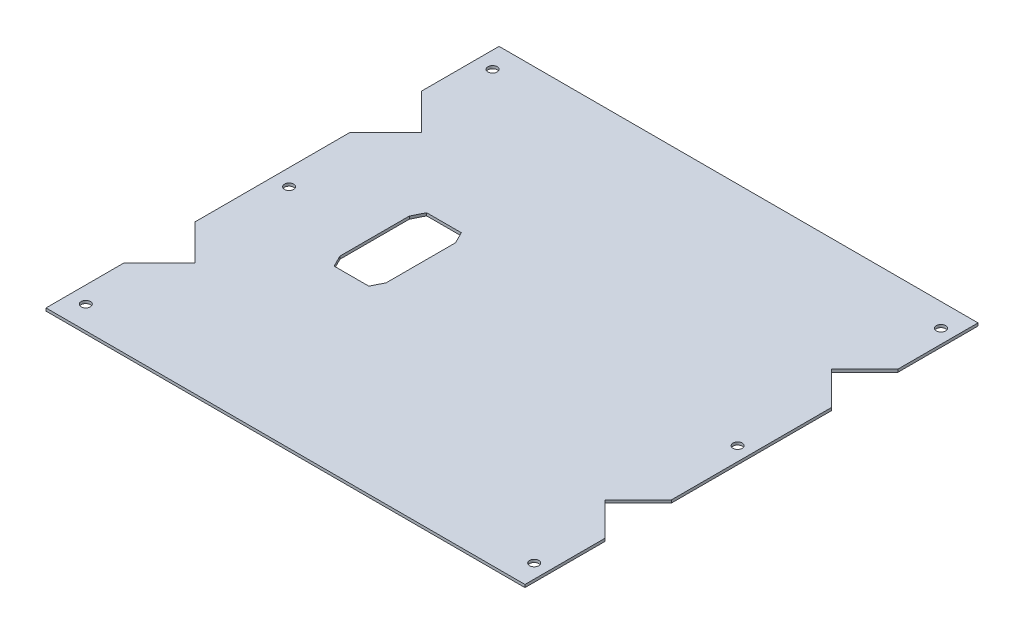
ISO-10303-21;
HEADER;
FILE_DESCRIPTION(('STEP AP214'),'2;1');
FILE_NAME('part.step','',(''),(''),'','','');
FILE_SCHEMA(('AUTOMOTIVE_DESIGN { 1 0 10303 214 1 1 1 1 }'));
ENDSEC;
DATA;
#1=APPLICATION_CONTEXT('core data for automotive mechanical design processes');
#2=APPLICATION_PROTOCOL_DEFINITION('international standard','automotive_design',2000,#1);
#3=PRODUCT_CONTEXT('',#1,'mechanical');
#4=PRODUCT('Part','Part','',(#3));
#5=PRODUCT_RELATED_PRODUCT_CATEGORY('part','',(#4));
#6=PRODUCT_DEFINITION_FORMATION('','',#4);
#7=PRODUCT_DEFINITION_CONTEXT('part definition',#1,'design');
#8=PRODUCT_DEFINITION('design','',#6,#7);
#9=PRODUCT_DEFINITION_SHAPE('','',#8);
#10=(LENGTH_UNIT() NAMED_UNIT(*) SI_UNIT(.MILLI.,.METRE.));
#11=(NAMED_UNIT(*) PLANE_ANGLE_UNIT() SI_UNIT($,.RADIAN.));
#12=(NAMED_UNIT(*) SI_UNIT($,.STERADIAN.) SOLID_ANGLE_UNIT());
#13=UNCERTAINTY_MEASURE_WITH_UNIT(LENGTH_MEASURE(1.E-05),#10,'distance_accuracy_value','');
#14=(GEOMETRIC_REPRESENTATION_CONTEXT(3) GLOBAL_UNCERTAINTY_ASSIGNED_CONTEXT((#13)) GLOBAL_UNIT_ASSIGNED_CONTEXT((#10,
#11,#12)) REPRESENTATION_CONTEXT('',''));
#15=CARTESIAN_POINT('',(0.,0.,0.));
#16=DIRECTION('',(0.,0.,1.));
#17=DIRECTION('',(1.,0.,0.));
#18=AXIS2_PLACEMENT_3D('',#15,#16,#17);
#19=CARTESIAN_POINT('',(0.,1.2,0.));
#20=DIRECTION('',(0.,-1.,0.));
#21=DIRECTION('',(0.,0.,-1.));
#22=AXIS2_PLACEMENT_3D('',#19,#20,#21);
#23=PLANE('',#22);
#24=DIRECTION('',(0.707106781186555,0.,0.70710678118654));
#25=VECTOR('',#24,1.);
#26=CARTESIAN_POINT('',(-6.94800186834975,1.19999999999923,-9.37677669530754));
#27=LINE('',#26,#25);
#28=CARTESIAN_POINT('',(-14.1247785636571,1.19999999999916,-16.5535533906148));
#29=VERTEX_POINT('',#28);
#30=CARTESIAN_POINT('',(1.39116410875926,1.19999999999932,-1.0376107181987));
#31=VERTEX_POINT('',#30);
#32=EDGE_CURVE('E728',#29,#31,#27,.T.);
#33=ORIENTED_EDGE('',*,*,#32,.T.);
#34=DIRECTION('',(-0.707106781186548,0.,0.707106781186547));
#35=VECTOR('',#34,1.);
#36=CARTESIAN_POINT('',(-30.8480018683815,1.1999999999987,31.201555258942));
#37=LINE('',#36,#35);
#38=CARTESIAN_POINT('',(-14.1247785636572,1.19999999999876,14.4783319542178));
#39=VERTEX_POINT('',#38);
#40=EDGE_CURVE('E616',#31,#39,#37,.T.);
#41=ORIENTED_EDGE('',*,*,#40,.T.);
#42=DIRECTION('',(0.,0.,1.));
#43=VECTOR('',#42,1.);
#44=CARTESIAN_POINT('',(-14.1247785636572,1.19999999999864,47.9247785636663));
#45=LINE('',#44,#43);
#46=CARTESIAN_POINT('',(-14.1247785636572,1.19999999999864,47.9247785636663));
#47=VERTEX_POINT('',#46);
#48=EDGE_CURVE('E630',#47,#39,#45,.F.);
#49=ORIENTED_EDGE('',*,*,#48,.F.);
#50=DIRECTION('',(1.,0.,0.));
#51=VECTOR('',#50,1.);
#52=CARTESIAN_POINT('',(192.924778563662,1.19999999999861,47.9247785636663));
#53=LINE('',#52,#51);
#54=CARTESIAN_POINT('',(192.924778563662,1.19999999999861,47.924778563666));
#55=VERTEX_POINT('',#54);
#56=EDGE_CURVE('E619',#47,#55,#53,.T.);
#57=ORIENTED_EDGE('',*,*,#56,.T.);
#58=DIRECTION('',(0.,0.,-1.));
#59=VECTOR('',#58,1.);
#60=CARTESIAN_POINT('',(192.924778563662,1.19999999999961,0.124778563666265));
#61=LINE('',#60,#59);
#62=CARTESIAN_POINT('',(192.924778563662,1.19999999999932,13.2783319542393));
#63=VERTEX_POINT('',#62);
#64=EDGE_CURVE('E639',#63,#55,#61,.F.);
#65=ORIENTED_EDGE('',*,*,#64,.F.);
#66=DIRECTION('',(-0.70710678118656,0.,-0.707106781186535));
#67=VECTOR('',#66,1.);
#68=CARTESIAN_POINT('',(186.348001868375,1.19999999999945,6.70155525895304));
#69=LINE('',#68,#67);
#70=CARTESIAN_POINT('',(178.608835891259,1.19999999999966,-1.03761071816298));
#71=VERTEX_POINT('',#70);
#72=EDGE_CURVE('E622',#63,#71,#69,.T.);
#73=ORIENTED_EDGE('',*,*,#72,.T.);
#74=DIRECTION('',(0.707106781186542,0.,-0.707106781186553));
#75=VECTOR('',#74,1.);
#76=CARTESIAN_POINT('',(234.148001868379,1.19999999999978,-56.5767766952838));
#77=LINE('',#76,#75);
#78=CARTESIAN_POINT('',(192.924778563662,1.19999999999956,-15.3535533905662));
#79=VERTEX_POINT('',#78);
#80=EDGE_CURVE('E702',#71,#79,#77,.T.);
#81=ORIENTED_EDGE('',*,*,#80,.T.);
#82=DIRECTION('',(0.,0.,-1.));
#83=VECTOR('',#82,1.);
#84=CARTESIAN_POINT('',(192.924778563662,1.20000000000015,-97.8));
#85=LINE('',#84,#83);
#86=CARTESIAN_POINT('',(192.924778563662,1.20000000000003,-84.6464466093866));
#87=VERTEX_POINT('',#86);
#88=EDGE_CURVE('E711',#87,#79,#85,.F.);
#89=ORIENTED_EDGE('',*,*,#88,.F.);
#90=DIRECTION('',(-0.707106781186554,0.,-0.707106781186541));
#91=VECTOR('',#90,1.);
#92=CARTESIAN_POINT('',(186.348001868355,1.20000000000009,-91.2232233046932));
#93=LINE('',#92,#91);
#94=CARTESIAN_POINT('',(178.608835891231,1.20000000000018,-98.9623892818179));
#95=VERTEX_POINT('',#94);
#96=EDGE_CURVE('E700',#87,#95,#93,.T.);
#97=ORIENTED_EDGE('',*,*,#96,.T.);
#98=DIRECTION('',(0.707106781186549,0.,-0.707106781186546));
#99=VECTOR('',#98,1.);
#100=CARTESIAN_POINT('',(210.248001868367,1.19999999999959,-130.601555258954));
#101=LINE('',#100,#99);
#102=CARTESIAN_POINT('',(192.924778563662,1.19999999999973,-113.278331954249));
#103=VERTEX_POINT('',#102);
#104=EDGE_CURVE('E595',#95,#103,#101,.T.);
#105=ORIENTED_EDGE('',*,*,#104,.T.);
#106=DIRECTION('',(0.,0.,-1.));
#107=VECTOR('',#106,1.);
#108=CARTESIAN_POINT('',(192.924778563662,1.19999999999949,-147.924778563659));
#109=LINE('',#108,#107);
#110=CARTESIAN_POINT('',(192.924778563662,1.19999999999949,-147.924778563659));
#111=VERTEX_POINT('',#110);
#112=EDGE_CURVE('E665',#111,#103,#109,.F.);
#113=ORIENTED_EDGE('',*,*,#112,.F.);
#114=DIRECTION('',(1.,0.,0.));
#115=VECTOR('',#114,1.);
#116=CARTESIAN_POINT('',(192.924778563662,1.19999999999949,-147.924778563659));
#117=LINE('',#116,#115);
#118=CARTESIAN_POINT('',(-14.1247785636571,1.19999999999783,-147.924778563659));
#119=VERTEX_POINT('',#118);
#120=EDGE_CURVE('E661',#111,#119,#117,.F.);
#121=ORIENTED_EDGE('',*,*,#120,.T.);
#122=DIRECTION('',(0.,0.,1.));
#123=VECTOR('',#122,1.);
#124=CARTESIAN_POINT('',(-14.1247785636571,1.19999999999899,-100.124778563659));
#125=LINE('',#124,#123);
#126=CARTESIAN_POINT('',(-14.1247785636571,1.19999999999865,-114.478331954274));
#127=VERTEX_POINT('',#126);
#128=EDGE_CURVE('E676',#127,#119,#125,.F.);
#129=ORIENTED_EDGE('',*,*,#128,.F.);
#130=DIRECTION('',(0.707106781186561,0.,0.707106781186534));
#131=VECTOR('',#130,1.);
#132=CARTESIAN_POINT('',(-6.94800186834975,1.19999999999883,-107.301555258966));
#133=LINE('',#132,#131);
#134=CARTESIAN_POINT('',(1.39116410876367,1.19999999999902,-98.9623892818534));
#135=VERTEX_POINT('',#134);
#136=EDGE_CURVE('E659',#127,#135,#133,.T.);
#137=ORIENTED_EDGE('',*,*,#136,.T.);
#138=DIRECTION('',(-0.707106781186541,0.,0.707106781186554));
#139=VECTOR('',#138,1.);
#140=CARTESIAN_POINT('',(-54.7480018683733,1.19999999999889,-42.8232233047154));
#141=LINE('',#140,#139);
#142=CARTESIAN_POINT('',(-14.1247785636571,1.19999999999846,-83.4464466094323));
#143=VERTEX_POINT('',#142);
#144=EDGE_CURVE('E730',#135,#143,#141,.T.);
#145=ORIENTED_EDGE('',*,*,#144,.T.);
#146=DIRECTION('',(0.,0.,1.));
#147=VECTOR('',#146,1.);
#148=CARTESIAN_POINT('',(-14.1247785636571,1.19999999999931,-2.2));
#149=LINE('',#148,#147);
#150=EDGE_CURVE('E736',#29,#143,#149,.F.);
#151=ORIENTED_EDGE('',*,*,#150,.F.);
#152=EDGE_LOOP('',(#33,#41,#49,#57,#65,#73,#81,#89,#97,#105,#113,#121,#129,#137,#145,#151));
#153=FACE_BOUND('',#152,.T.);
#154=DIRECTION('',(-0.447213595499958,0.,0.894427190999916));
#155=VECTOR('',#154,1.);
#156=CARTESIAN_POINT('',(30.,1.2,-65.));
#157=LINE('',#156,#155);
#158=CARTESIAN_POINT('',(32.5,1.2,-70.));
#159=VERTEX_POINT('',#158);
#160=CARTESIAN_POINT('',(30.,1.2,-65.));
#161=VERTEX_POINT('',#160);
#162=EDGE_CURVE('E740',#159,#161,#157,.T.);
#163=ORIENTED_EDGE('',*,*,#162,.F.);
#164=DIRECTION('',(-1.,0.,0.));
#165=VECTOR('',#164,1.);
#166=CARTESIAN_POINT('',(32.5,1.2,-70.));
#167=LINE('',#166,#165);
#168=CARTESIAN_POINT('',(47.5,1.2,-70.));
#169=VERTEX_POINT('',#168);
#170=EDGE_CURVE('E755',#169,#159,#167,.T.);
#171=ORIENTED_EDGE('',*,*,#170,.F.);
#172=DIRECTION('',(-0.447213595499958,0.,-0.894427190999916));
#173=VECTOR('',#172,1.);
#174=CARTESIAN_POINT('',(47.5,1.2,-70.));
#175=LINE('',#174,#173);
#176=CARTESIAN_POINT('',(50.,1.2,-65.));
#177=VERTEX_POINT('',#176);
#178=EDGE_CURVE('E753',#177,#169,#175,.T.);
#179=ORIENTED_EDGE('',*,*,#178,.F.);
#180=DIRECTION('',(0.,0.,-1.));
#181=VECTOR('',#180,1.);
#182=CARTESIAN_POINT('',(50.,1.2,-65.));
#183=LINE('',#182,#181);
#184=CARTESIAN_POINT('',(50.,1.2,-35.));
#185=VERTEX_POINT('',#184);
#186=EDGE_CURVE('E751',#185,#177,#183,.T.);
#187=ORIENTED_EDGE('',*,*,#186,.F.);
#188=DIRECTION('',(0.447213595499959,0.,-0.894427190999915));
#189=VECTOR('',#188,1.);
#190=CARTESIAN_POINT('',(50.,1.2,-35.));
#191=LINE('',#190,#189);
#192=CARTESIAN_POINT('',(47.5,1.2,-30.));
#193=VERTEX_POINT('',#192);
#194=EDGE_CURVE('E749',#193,#185,#191,.T.);
#195=ORIENTED_EDGE('',*,*,#194,.F.);
#196=DIRECTION('',(1.,0.,0.));
#197=VECTOR('',#196,1.);
#198=CARTESIAN_POINT('',(47.5,1.2,-30.));
#199=LINE('',#198,#197);
#200=CARTESIAN_POINT('',(32.5,1.2,-30.));
#201=VERTEX_POINT('',#200);
#202=EDGE_CURVE('E747',#201,#193,#199,.T.);
#203=ORIENTED_EDGE('',*,*,#202,.F.);
#204=DIRECTION('',(0.447213595499958,0.,0.894427190999916));
#205=VECTOR('',#204,1.);
#206=CARTESIAN_POINT('',(32.5,1.2,-30.));
#207=LINE('',#206,#205);
#208=CARTESIAN_POINT('',(30.,1.2,-35.));
#209=VERTEX_POINT('',#208);
#210=EDGE_CURVE('E745',#209,#201,#207,.T.);
#211=ORIENTED_EDGE('',*,*,#210,.F.);
#212=DIRECTION('',(0.,0.,1.));
#213=VECTOR('',#212,1.);
#214=CARTESIAN_POINT('',(30.,1.2,-65.));
#215=LINE('',#214,#213);
#216=EDGE_CURVE('E742',#161,#209,#215,.T.);
#217=ORIENTED_EDGE('',*,*,#216,.F.);
#218=EDGE_LOOP('',(#163,#171,#179,#187,#195,#203,#211,#217));
#219=FACE_BOUND('',#218,.T.);
#220=CARTESIAN_POINT('',(-6.9247785635766,1.19999999999881,-49.9999999999999));
#221=DIRECTION('',(0.,1.,0.));
#222=DIRECTION('',(-1.,0.,0.));
#223=AXIS2_PLACEMENT_3D('',#220,#221,#222);
#224=CIRCLE('',#223,2.);
#225=CARTESIAN_POINT('',(-8.92477856357661,1.19999999999881,-49.9999999999999));
#226=VERTEX_POINT('',#225);
#227=EDGE_CURVE('E733',#226,#226,#224,.T.);
#228=ORIENTED_EDGE('',*,*,#227,.F.);
#229=EDGE_LOOP('',(#228));
#230=FACE_BOUND('',#229,.T.);
#231=CARTESIAN_POINT('',(186.924778563663,1.19999999999984,-50.0000000000001));
#232=DIRECTION('',(0.,1.,0.));
#233=DIRECTION('',(-1.,0.,0.));
#234=AXIS2_PLACEMENT_3D('',#231,#232,#233);
#235=CIRCLE('',#234,2.);
#236=CARTESIAN_POINT('',(184.924778563663,1.19999999999984,-50.));
#237=VERTEX_POINT('',#236);
#238=EDGE_CURVE('E708',#237,#237,#235,.T.);
#239=ORIENTED_EDGE('',*,*,#238,.F.);
#240=EDGE_LOOP('',(#239));
#241=FACE_BOUND('',#240,.T.);
#242=CARTESIAN_POINT('',(-6.92477856365785,1.19999999999808,-137.924778563577));
#243=DIRECTION('',(0.,1.,0.));
#244=DIRECTION('',(1.,0.,0.));
#245=AXIS2_PLACEMENT_3D('',#242,#243,#244);
#246=CIRCLE('',#245,2.);
#247=CARTESIAN_POINT('',(-4.92477856365785,1.19999999999808,-137.924778563577));
#248=VERTEX_POINT('',#247);
#249=EDGE_CURVE('E686',#248,#248,#246,.T.);
#250=ORIENTED_EDGE('',*,*,#249,.F.);
#251=EDGE_LOOP('',(#250));
#252=FACE_BOUND('',#251,.T.);
#253=CARTESIAN_POINT('',(186.924778563663,1.19999999999959,-137.924778563658));
#254=DIRECTION('',(0.,1.,0.));
#255=DIRECTION('',(1.,0.,0.));
#256=AXIS2_PLACEMENT_3D('',#253,#254,#255);
#257=CIRCLE('',#256,2.);
#258=CARTESIAN_POINT('',(188.924778563663,1.19999999999959,-137.924778563658));
#259=VERTEX_POINT('',#258);
#260=EDGE_CURVE('E610',#259,#259,#257,.T.);
#261=ORIENTED_EDGE('',*,*,#260,.F.);
#262=EDGE_LOOP('',(#261));
#263=FACE_BOUND('',#262,.T.);
#264=CARTESIAN_POINT('',(-6.92477856365739,1.19999999999868,37.9247785636069));
#265=DIRECTION('',(0.,1.,0.));
#266=DIRECTION('',(-1.,0.,0.));
#267=AXIS2_PLACEMENT_3D('',#264,#265,#266);
#268=CIRCLE('',#267,2.);
#269=CARTESIAN_POINT('',(-8.92477856365739,1.19999999999868,37.9247785636069));
#270=VERTEX_POINT('',#269);
#271=EDGE_CURVE('E644',#270,#270,#268,.T.);
#272=ORIENTED_EDGE('',*,*,#271,.F.);
#273=EDGE_LOOP('',(#272));
#274=FACE_BOUND('',#273,.T.);
#275=CARTESIAN_POINT('',(186.924778563663,1.19999999999884,37.9247785636883));
#276=DIRECTION('',(0.,1.,0.));
#277=DIRECTION('',(-1.,0.,0.));
#278=AXIS2_PLACEMENT_3D('',#275,#276,#277);
#279=CIRCLE('',#278,2.);
#280=CARTESIAN_POINT('',(184.924778563663,1.19999999999885,37.9247785636883));
#281=VERTEX_POINT('',#280);
#282=EDGE_CURVE('E607',#281,#281,#279,.T.);
#283=ORIENTED_EDGE('',*,*,#282,.F.);
#284=EDGE_LOOP('',(#283));
#285=FACE_BOUND('',#284,.T.);
#286=ADVANCED_FACE('F405',(#153,#219,#230,#241,#252,#263,#274,#285),#23,.F.);
#287=CARTESIAN_POINT('',(0.,0.,0.));
#288=DIRECTION('',(0.,-1.,0.));
#289=DIRECTION('',(0.,0.,-1.));
#290=AXIS2_PLACEMENT_3D('',#287,#288,#289);
#291=PLANE('',#290);
#292=DIRECTION('',(-0.707106781186548,0.,0.707106781186547));
#293=VECTOR('',#292,1.);
#294=CARTESIAN_POINT('',(-30.8480018683815,-1.29582619200439E-12,31.201555258942));
#295=LINE('',#294,#293);
#296=CARTESIAN_POINT('',(1.39116410875926,-6.79577921713914E-13,-1.03761071819869));
#297=VERTEX_POINT('',#296);
#298=CARTESIAN_POINT('',(-14.1247785636572,-1.2410198431973E-12,14.4783319542178));
#299=VERTEX_POINT('',#298);
#300=EDGE_CURVE('E611',#297,#299,#295,.T.);
#301=ORIENTED_EDGE('',*,*,#300,.F.);
#302=DIRECTION('',(0.707106781186555,0.,0.70710678118654));
#303=VECTOR('',#302,1.);
#304=CARTESIAN_POINT('',(-6.94800186834975,-7.65656002575989E-13,-9.37677669530752));
#305=LINE('',#304,#303);
#306=CARTESIAN_POINT('',(-14.1247785636571,-8.39999230612606E-13,-16.5535533906148));
#307=VERTEX_POINT('',#306);
#308=EDGE_CURVE('E715',#307,#297,#305,.T.);
#309=ORIENTED_EDGE('',*,*,#308,.F.);
#310=DIRECTION('',(0.,0.,1.));
#311=VECTOR('',#310,1.);
#312=CARTESIAN_POINT('',(-14.1247785636571,-6.89132830271576E-13,-2.19999999999998));
#313=LINE('',#312,#311);
#314=CARTESIAN_POINT('',(-14.1247785636571,-1.54309272486321E-12,-83.4464466094323));
#315=VERTEX_POINT('',#314);
#316=EDGE_CURVE('E717',#307,#315,#313,.F.);
#317=ORIENTED_EDGE('',*,*,#316,.T.);
#318=DIRECTION('',(-0.707106781186541,0.,0.707106781186554));
#319=VECTOR('',#318,1.);
#320=CARTESIAN_POINT('',(-54.7480018683733,-1.10907167342339E-12,-42.8232233047154));
#321=LINE('',#320,#319);
#322=CARTESIAN_POINT('',(1.39116410876367,-9.8055244479589E-13,-98.9623892818533));
#323=VERTEX_POINT('',#322);
#324=EDGE_CURVE('E725',#323,#315,#321,.T.);
#325=ORIENTED_EDGE('',*,*,#324,.F.);
#326=DIRECTION('',(0.707106781186561,0.,0.707106781186534));
#327=VECTOR('',#326,1.);
#328=CARTESIAN_POINT('',(-6.94800186834975,-1.17961196366423E-12,-107.301555258966));
#329=LINE('',#328,#327);
#330=CARTESIAN_POINT('',(-14.1247785636571,-1.346145417358E-12,-114.478331954273));
#331=VERTEX_POINT('',#330);
#332=EDGE_CURVE('E590',#331,#323,#329,.T.);
#333=ORIENTED_EDGE('',*,*,#332,.F.);
#334=DIRECTION('',(0.,0.,1.));
#335=VECTOR('',#334,1.);
#336=CARTESIAN_POINT('',(-14.1247785636571,-1.01307850997046E-12,-100.124778563659));
#337=LINE('',#336,#335);
#338=CARTESIAN_POINT('',(-14.1247785636571,-2.17881268582687E-12,-147.924778563659));
#339=VERTEX_POINT('',#338);
#340=EDGE_CURVE('E670',#331,#339,#337,.F.);
#341=ORIENTED_EDGE('',*,*,#340,.T.);
#342=DIRECTION('',(1.,0.,0.));
#343=VECTOR('',#342,1.);
#344=CARTESIAN_POINT('',(192.924778563662,-5.13478148889135E-13,-147.924778563659));
#345=LINE('',#344,#343);
#346=CARTESIAN_POINT('',(192.924778563662,-5.13478148889135E-13,-147.924778563659));
#347=VERTEX_POINT('',#346);
#348=EDGE_CURVE('E684',#347,#339,#345,.F.);
#349=ORIENTED_EDGE('',*,*,#348,.F.);
#350=DIRECTION('',(0.,0.,-1.));
#351=VECTOR('',#350,1.);
#352=CARTESIAN_POINT('',(192.924778563662,-5.13478148889135E-13,-147.924778563659));
#353=LINE('',#352,#351);
#354=CARTESIAN_POINT('',(192.924778563662,-2.77555756156289E-13,-113.278331954249));
#355=VERTEX_POINT('',#354);
#356=EDGE_CURVE('E587',#347,#355,#353,.F.);
#357=ORIENTED_EDGE('',*,*,#356,.T.);
#358=DIRECTION('',(0.707106781186549,0.,-0.707106781186546));
#359=VECTOR('',#358,1.);
#360=CARTESIAN_POINT('',(210.248001868367,-4.16333634234434E-13,-130.601555258954));
#361=LINE('',#360,#359);
#362=CARTESIAN_POINT('',(178.608835891231,1.76074432811646E-13,-98.9623892818179));
#363=VERTEX_POINT('',#362);
#364=EDGE_CURVE('E582',#363,#355,#361,.T.);
#365=ORIENTED_EDGE('',*,*,#364,.F.);
#366=DIRECTION('',(-0.707106781186554,0.,-0.707106781186541));
#367=VECTOR('',#366,1.);
#368=CARTESIAN_POINT('',(186.348001868355,0.,-91.2232233046932));
#369=LINE('',#368,#367);
#370=CARTESIAN_POINT('',(192.924778563662,0.,-84.6464466093866));
#371=VERTEX_POINT('',#370);
#372=EDGE_CURVE('E567',#371,#363,#369,.T.);
#373=ORIENTED_EDGE('',*,*,#372,.F.);
#374=DIRECTION('',(0.,0.,-1.));
#375=VECTOR('',#374,1.);
#376=CARTESIAN_POINT('',(192.924778563662,1.38777878078145E-13,-97.8));
#377=LINE('',#376,#375);
#378=CARTESIAN_POINT('',(192.924778563662,-4.44089209850063E-13,-15.3535533905662));
#379=VERTEX_POINT('',#378);
#380=EDGE_CURVE('E578',#371,#379,#377,.F.);
#381=ORIENTED_EDGE('',*,*,#380,.T.);
#382=DIRECTION('',(0.707106781186542,0.,-0.707106781186553));
#383=VECTOR('',#382,1.);
#384=CARTESIAN_POINT('',(234.148001868379,-2.22044604925031E-13,-56.5767766952838));
#385=LINE('',#384,#383);
#386=CARTESIAN_POINT('',(178.608835891259,-3.3957212042246E-13,-1.03761071816301));
#387=VERTEX_POINT('',#386);
#388=EDGE_CURVE('E697',#387,#379,#385,.T.);
#389=ORIENTED_EDGE('',*,*,#388,.F.);
#390=DIRECTION('',(-0.70710678118656,0.,-0.707106781186535));
#391=VECTOR('',#390,1.);
#392=CARTESIAN_POINT('',(186.348001868375,-5.54964122660777E-13,6.70155525895301));
#393=LINE('',#392,#391);
#394=CARTESIAN_POINT('',(192.924778563662,-6.88949118224623E-13,13.2783319542393));
#395=VERTEX_POINT('',#394);
#396=EDGE_CURVE('E614',#395,#387,#393,.T.);
#397=ORIENTED_EDGE('',*,*,#396,.F.);
#398=DIRECTION('',(0.,0.,-1.));
#399=VECTOR('',#398,1.);
#400=CARTESIAN_POINT('',(192.924778563662,-3.932235514813E-13,0.124778563666239));
#401=LINE('',#400,#399);
#402=CARTESIAN_POINT('',(192.924778563662,-1.39278362794687E-12,47.924778563666));
#403=VERTEX_POINT('',#402);
#404=EDGE_CURVE('E636',#395,#403,#401,.F.);
#405=ORIENTED_EDGE('',*,*,#404,.T.);
#406=DIRECTION('',(1.,0.,0.));
#407=VECTOR('',#406,1.);
#408=CARTESIAN_POINT('',(192.924778563662,-1.39278362794687E-12,47.9247785636663));
#409=LINE('',#408,#407);
#410=CARTESIAN_POINT('',(-14.1247785636572,-1.35658367282159E-12,47.9247785636663));
#411=VERTEX_POINT('',#410);
#412=EDGE_CURVE('E649',#411,#403,#409,.T.);
#413=ORIENTED_EDGE('',*,*,#412,.F.);
#414=DIRECTION('',(0.,0.,1.));
#415=VECTOR('',#414,1.);
#416=CARTESIAN_POINT('',(-14.1247785636572,-1.35658367282159E-12,47.9247785636663));
#417=LINE('',#416,#415);
#418=EDGE_CURVE('E624',#411,#299,#417,.F.);
#419=ORIENTED_EDGE('',*,*,#418,.T.);
#420=EDGE_LOOP('',(#301,#309,#317,#325,#333,#341,#349,#357,#365,#373,#381,#389,#397,#405,#413,#419));
#421=FACE_BOUND('',#420,.T.);
#422=DIRECTION('',(-1.,0.,0.));
#423=VECTOR('',#422,1.);
#424=CARTESIAN_POINT('',(32.5,0.,-70.));
#425=LINE('',#424,#423);
#426=CARTESIAN_POINT('',(47.5,0.,-70.));
#427=VERTEX_POINT('',#426);
#428=CARTESIAN_POINT('',(32.5,0.,-70.));
#429=VERTEX_POINT('',#428);
#430=EDGE_CURVE('E743',#427,#429,#425,.T.);
#431=ORIENTED_EDGE('',*,*,#430,.T.);
#432=DIRECTION('',(-0.447213595499958,0.,0.894427190999916));
#433=VECTOR('',#432,1.);
#434=CARTESIAN_POINT('',(30.,0.,-65.));
#435=LINE('',#434,#433);
#436=CARTESIAN_POINT('',(30.,0.,-65.));
#437=VERTEX_POINT('',#436);
#438=EDGE_CURVE('E427',#429,#437,#435,.T.);
#439=ORIENTED_EDGE('',*,*,#438,.T.);
#440=DIRECTION('',(0.,0.,1.));
#441=VECTOR('',#440,1.);
#442=CARTESIAN_POINT('',(30.,0.,-65.));
#443=LINE('',#442,#441);
#444=CARTESIAN_POINT('',(30.,0.,-35.));
#445=VERTEX_POINT('',#444);
#446=EDGE_CURVE('E759',#437,#445,#443,.T.);
#447=ORIENTED_EDGE('',*,*,#446,.T.);
#448=DIRECTION('',(0.447213595499958,0.,0.894427190999916));
#449=VECTOR('',#448,1.);
#450=CARTESIAN_POINT('',(32.5,0.,-30.));
#451=LINE('',#450,#449);
#452=CARTESIAN_POINT('',(32.5,0.,-30.));
#453=VERTEX_POINT('',#452);
#454=EDGE_CURVE('E762',#445,#453,#451,.T.);
#455=ORIENTED_EDGE('',*,*,#454,.T.);
#456=DIRECTION('',(1.,0.,0.));
#457=VECTOR('',#456,1.);
#458=CARTESIAN_POINT('',(47.5,0.,-30.));
#459=LINE('',#458,#457);
#460=CARTESIAN_POINT('',(47.5,0.,-30.));
#461=VERTEX_POINT('',#460);
#462=EDGE_CURVE('E765',#453,#461,#459,.T.);
#463=ORIENTED_EDGE('',*,*,#462,.T.);
#464=DIRECTION('',(0.447213595499959,0.,-0.894427190999915));
#465=VECTOR('',#464,1.);
#466=CARTESIAN_POINT('',(50.,0.,-35.));
#467=LINE('',#466,#465);
#468=CARTESIAN_POINT('',(50.,0.,-35.));
#469=VERTEX_POINT('',#468);
#470=EDGE_CURVE('E768',#461,#469,#467,.T.);
#471=ORIENTED_EDGE('',*,*,#470,.T.);
#472=DIRECTION('',(0.,0.,-1.));
#473=VECTOR('',#472,1.);
#474=CARTESIAN_POINT('',(50.,0.,-65.));
#475=LINE('',#474,#473);
#476=CARTESIAN_POINT('',(50.,0.,-65.));
#477=VERTEX_POINT('',#476);
#478=EDGE_CURVE('E771',#469,#477,#475,.T.);
#479=ORIENTED_EDGE('',*,*,#478,.T.);
#480=DIRECTION('',(-0.447213595499958,0.,-0.894427190999916));
#481=VECTOR('',#480,1.);
#482=CARTESIAN_POINT('',(47.5,0.,-70.));
#483=LINE('',#482,#481);
#484=EDGE_CURVE('E774',#477,#427,#483,.T.);
#485=ORIENTED_EDGE('',*,*,#484,.T.);
#486=EDGE_LOOP('',(#431,#439,#447,#455,#463,#471,#479,#485));
#487=FACE_BOUND('',#486,.T.);
#488=CARTESIAN_POINT('',(-6.92477856357606,-5.32930234079004E-12,-49.9999999999999));
#489=DIRECTION('',(-4.58830951171779E-13,1.,0.));
#490=DIRECTION('',(-1.,-4.58830951171779E-13,0.));
#491=AXIS2_PLACEMENT_3D('',#488,#489,#490);
#492=CIRCLE('',#491,2.);
#493=CARTESIAN_POINT('',(-8.92477856357606,-6.2469642431336E-12,-49.9999999999999));
#494=VERTEX_POINT('',#493);
#495=EDGE_CURVE('E720',#494,#494,#492,.T.);
#496=ORIENTED_EDGE('',*,*,#495,.T.);
#497=EDGE_LOOP('',(#496));
#498=FACE_BOUND('',#497,.T.);
#499=CARTESIAN_POINT('',(186.924778563663,-1.66533453693773E-13,-50.0000000000001));
#500=DIRECTION('',(0.,-1.,0.));
#501=DIRECTION('',(1.,0.,0.));
#502=AXIS2_PLACEMENT_3D('',#499,#500,#501);
#503=CIRCLE('',#502,2.);
#504=CARTESIAN_POINT('',(188.924778563663,-1.69667643219416E-13,-50.0000000000001));
#505=VERTEX_POINT('',#504);
#506=EDGE_CURVE('E705',#505,#505,#503,.T.);
#507=ORIENTED_EDGE('',*,*,#506,.F.);
#508=EDGE_LOOP('',(#507));
#509=FACE_BOUND('',#508,.T.);
#510=CARTESIAN_POINT('',(186.924778563662,1.37945210809676E-11,-137.924778563659));
#511=DIRECTION('',(-4.60459278274553E-13,-1.,-4.51916738706496E-13));
#512=DIRECTION('',(0.,4.51916738706495E-13,-1.));
#513=AXIS2_PLACEMENT_3D('',#510,#511,#512);
#514=CIRCLE('',#513,2.);
#515=CARTESIAN_POINT('',(186.924778563662,1.46983545583806E-11,-139.924778563659));
#516=VERTEX_POINT('',#515);
#517=EDGE_CURVE('E689',#516,#516,#514,.T.);
#518=ORIENTED_EDGE('',*,*,#517,.F.);
#519=EDGE_LOOP('',(#518));
#520=FACE_BOUND('',#519,.T.);
#521=CARTESIAN_POINT('',(-6.92477856365785,-2.02754479872169E-11,-137.924778563576));
#522=DIRECTION('',(0.,1.,-4.83368844169747E-13));
#523=DIRECTION('',(0.,-4.83368844169747E-13,-1.));
#524=AXIS2_PLACEMENT_3D('',#521,#522,#523);
#525=CIRCLE('',#524,2.);
#526=CARTESIAN_POINT('',(-6.92477856365789,-2.12421856755564E-11,-139.924778563576));
#527=VERTEX_POINT('',#526);
#528=EDGE_CURVE('E673',#527,#527,#525,.T.);
#529=ORIENTED_EDGE('',*,*,#528,.T.);
#530=EDGE_LOOP('',(#529));
#531=FACE_BOUND('',#530,.T.);
#532=CARTESIAN_POINT('',(-6.92477856365739,-1.96706428505484E-11,37.9247785636064));
#533=DIRECTION('',(0.,1.,4.62347373564471E-13));
#534=DIRECTION('',(0.,-4.62347373564471E-13,1.));
#535=AXIS2_PLACEMENT_3D('',#532,#533,#534);
#536=CIRCLE('',#535,2.);
#537=CARTESIAN_POINT('',(-6.92477856365739,-2.05953375976774E-11,39.9247785636064));
#538=VERTEX_POINT('',#537);
#539=EDGE_CURVE('E627',#538,#538,#536,.T.);
#540=ORIENTED_EDGE('',*,*,#539,.T.);
#541=EDGE_LOOP('',(#540));
#542=FACE_BOUND('',#541,.T.);
#543=CARTESIAN_POINT('',(186.924778563663,1.31027860811841E-11,37.9247785636888));
#544=DIRECTION('',(-4.60459278274553E-13,-1.,4.37935777606231E-13));
#545=DIRECTION('',(0.,4.37935777606223E-13,1.));
#546=AXIS2_PLACEMENT_3D('',#543,#544,#545);
#547=CIRCLE('',#546,2.);
#548=CARTESIAN_POINT('',(186.924778563663,1.39786576363966E-11,39.9247785636888));
#549=VERTEX_POINT('',#548);
#550=EDGE_CURVE('E652',#549,#549,#547,.T.);
#551=ORIENTED_EDGE('',*,*,#550,.F.);
#552=EDGE_LOOP('',(#551));
#553=FACE_BOUND('',#552,.T.);
#554=ADVANCED_FACE('F407',(#421,#487,#498,#509,#520,#531,#542,#553),#291,.T.);
#555=CARTESIAN_POINT('',(30.,1.2,-65.));
#556=DIRECTION('',(0.894427190999916,0.,0.447213595499958));
#557=DIRECTION('',(0.447213595499958,0.,-0.894427190999916));
#558=AXIS2_PLACEMENT_3D('',#555,#556,#557);
#559=PLANE('',#558);
#560=ORIENTED_EDGE('',*,*,#438,.F.);
#561=DIRECTION('',(0.,-1.,0.));
#562=VECTOR('',#561,1.);
#563=CARTESIAN_POINT('',(32.5,1.2,-70.));
#564=LINE('',#563,#562);
#565=EDGE_CURVE('E757',#159,#429,#564,.T.);
#566=ORIENTED_EDGE('',*,*,#565,.F.);
#567=ORIENTED_EDGE('',*,*,#162,.T.);
#568=DIRECTION('',(0.,-1.,0.));
#569=VECTOR('',#568,1.);
#570=CARTESIAN_POINT('',(30.,1.2,-65.));
#571=LINE('',#570,#569);
#572=EDGE_CURVE('E13',#161,#437,#571,.T.);
#573=ORIENTED_EDGE('',*,*,#572,.T.);
#574=EDGE_LOOP('',(#560,#566,#567,#573));
#575=FACE_BOUND('',#574,.T.);
#576=ADVANCED_FACE('F804',(#575),#559,.T.);
#577=CARTESIAN_POINT('',(30.,1.2,-65.));
#578=DIRECTION('',(1.,0.,0.));
#579=DIRECTION('',(0.,0.,-1.));
#580=AXIS2_PLACEMENT_3D('',#577,#578,#579);
#581=PLANE('',#580);
#582=ORIENTED_EDGE('',*,*,#446,.F.);
#583=ORIENTED_EDGE('',*,*,#572,.F.);
#584=ORIENTED_EDGE('',*,*,#216,.T.);
#585=DIRECTION('',(0.,-1.,0.));
#586=VECTOR('',#585,1.);
#587=CARTESIAN_POINT('',(30.,1.2,-35.));
#588=LINE('',#587,#586);
#589=EDGE_CURVE('E413',#209,#445,#588,.T.);
#590=ORIENTED_EDGE('',*,*,#589,.T.);
#591=EDGE_LOOP('',(#582,#583,#584,#590));
#592=FACE_BOUND('',#591,.T.);
#593=ADVANCED_FACE('F791',(#592),#581,.T.);
#594=CARTESIAN_POINT('',(32.5,1.2,-30.));
#595=DIRECTION('',(0.894427190999916,0.,-0.447213595499958));
#596=DIRECTION('',(-0.447213595499958,0.,-0.894427190999916));
#597=AXIS2_PLACEMENT_3D('',#594,#595,#596);
#598=PLANE('',#597);
#599=ORIENTED_EDGE('',*,*,#454,.F.);
#600=ORIENTED_EDGE('',*,*,#589,.F.);
#601=ORIENTED_EDGE('',*,*,#210,.T.);
#602=DIRECTION('',(0.,-1.,0.));
#603=VECTOR('',#602,1.);
#604=CARTESIAN_POINT('',(32.5,1.2,-30.));
#605=LINE('',#604,#603);
#606=EDGE_CURVE('E787',#201,#453,#605,.T.);
#607=ORIENTED_EDGE('',*,*,#606,.T.);
#608=EDGE_LOOP('',(#599,#600,#601,#607));
#609=FACE_BOUND('',#608,.T.);
#610=ADVANCED_FACE('F796',(#609),#598,.T.);
#611=CARTESIAN_POINT('',(47.5,1.2,-30.));
#612=DIRECTION('',(0.,0.,-1.));
#613=DIRECTION('',(-1.,0.,0.));
#614=AXIS2_PLACEMENT_3D('',#611,#612,#613);
#615=PLANE('',#614);
#616=ORIENTED_EDGE('',*,*,#462,.F.);
#617=ORIENTED_EDGE('',*,*,#606,.F.);
#618=ORIENTED_EDGE('',*,*,#202,.T.);
#619=DIRECTION('',(0.,-1.,0.));
#620=VECTOR('',#619,1.);
#621=CARTESIAN_POINT('',(47.5,1.2,-30.));
#622=LINE('',#621,#620);
#623=EDGE_CURVE('E785',#193,#461,#622,.T.);
#624=ORIENTED_EDGE('',*,*,#623,.T.);
#625=EDGE_LOOP('',(#616,#617,#618,#624));
#626=FACE_BOUND('',#625,.T.);
#627=ADVANCED_FACE('F811',(#626),#615,.T.);
#628=CARTESIAN_POINT('',(50.,1.2,-35.));
#629=DIRECTION('',(-0.894427190999915,0.,-0.447213595499959));
#630=DIRECTION('',(-0.447213595499959,0.,0.894427190999915));
#631=AXIS2_PLACEMENT_3D('',#628,#629,#630);
#632=PLANE('',#631);
#633=ORIENTED_EDGE('',*,*,#470,.F.);
#634=ORIENTED_EDGE('',*,*,#623,.F.);
#635=ORIENTED_EDGE('',*,*,#194,.T.);
#636=DIRECTION('',(0.,-1.,0.));
#637=VECTOR('',#636,1.);
#638=CARTESIAN_POINT('',(50.,1.2,-35.));
#639=LINE('',#638,#637);
#640=EDGE_CURVE('E783',#185,#469,#639,.T.);
#641=ORIENTED_EDGE('',*,*,#640,.T.);
#642=EDGE_LOOP('',(#633,#634,#635,#641));
#643=FACE_BOUND('',#642,.T.);
#644=ADVANCED_FACE('F816',(#643),#632,.T.);
#645=CARTESIAN_POINT('',(50.,1.2,-65.));
#646=DIRECTION('',(-1.,0.,0.));
#647=DIRECTION('',(0.,0.,1.));
#648=AXIS2_PLACEMENT_3D('',#645,#646,#647);
#649=PLANE('',#648);
#650=ORIENTED_EDGE('',*,*,#478,.F.);
#651=ORIENTED_EDGE('',*,*,#640,.F.);
#652=ORIENTED_EDGE('',*,*,#186,.T.);
#653=DIRECTION('',(0.,-1.,0.));
#654=VECTOR('',#653,1.);
#655=CARTESIAN_POINT('',(50.,1.2,-65.));
#656=LINE('',#655,#654);
#657=EDGE_CURVE('E781',#177,#477,#656,.T.);
#658=ORIENTED_EDGE('',*,*,#657,.T.);
#659=EDGE_LOOP('',(#650,#651,#652,#658));
#660=FACE_BOUND('',#659,.T.);
#661=ADVANCED_FACE('F820',(#660),#649,.T.);
#662=CARTESIAN_POINT('',(47.5,1.2,-70.));
#663=DIRECTION('',(-0.894427190999916,0.,0.447213595499958));
#664=DIRECTION('',(0.447213595499958,0.,0.894427190999916));
#665=AXIS2_PLACEMENT_3D('',#662,#663,#664);
#666=PLANE('',#665);
#667=ORIENTED_EDGE('',*,*,#484,.F.);
#668=ORIENTED_EDGE('',*,*,#657,.F.);
#669=ORIENTED_EDGE('',*,*,#178,.T.);
#670=DIRECTION('',(0.,-1.,0.));
#671=VECTOR('',#670,1.);
#672=CARTESIAN_POINT('',(47.5,1.2,-70.));
#673=LINE('',#672,#671);
#674=EDGE_CURVE('E420',#169,#427,#673,.T.);
#675=ORIENTED_EDGE('',*,*,#674,.T.);
#676=EDGE_LOOP('',(#667,#668,#669,#675));
#677=FACE_BOUND('',#676,.T.);
#678=ADVANCED_FACE('F823',(#677),#666,.T.);
#679=CARTESIAN_POINT('',(32.5,1.2,-70.));
#680=DIRECTION('',(0.,0.,1.));
#681=DIRECTION('',(1.,0.,0.));
#682=AXIS2_PLACEMENT_3D('',#679,#680,#681);
#683=PLANE('',#682);
#684=ORIENTED_EDGE('',*,*,#430,.F.);
#685=ORIENTED_EDGE('',*,*,#674,.F.);
#686=ORIENTED_EDGE('',*,*,#170,.T.);
#687=ORIENTED_EDGE('',*,*,#565,.T.);
#688=EDGE_LOOP('',(#684,#685,#686,#687));
#689=FACE_BOUND('',#688,.T.);
#690=ADVANCED_FACE('F801',(#689),#683,.T.);
#691=CARTESIAN_POINT('',(-14.1247785636571,-6.89132830271576E-13,-2.19999999999998));
#692=DIRECTION('',(-1.,0.,0.));
#693=DIRECTION('',(0.,0.,1.));
#694=AXIS2_PLACEMENT_3D('',#691,#692,#693);
#695=PLANE('',#694);
#696=DIRECTION('',(0.,1.,0.));
#697=VECTOR('',#696,1.);
#698=CARTESIAN_POINT('',(-14.1247785636571,-1.54309272486321E-12,-83.4464466094323));
#699=LINE('',#698,#697);
#700=EDGE_CURVE('E723',#315,#143,#699,.T.);
#701=ORIENTED_EDGE('',*,*,#700,.F.);
#702=ORIENTED_EDGE('',*,*,#316,.F.);
#703=DIRECTION('',(0.,1.,0.));
#704=VECTOR('',#703,1.);
#705=CARTESIAN_POINT('',(-14.1247785636571,-8.39999230612606E-13,-16.5535533906148));
#706=LINE('',#705,#704);
#707=EDGE_CURVE('E577',#307,#29,#706,.T.);
#708=ORIENTED_EDGE('',*,*,#707,.T.);
#709=ORIENTED_EDGE('',*,*,#150,.T.);
#710=EDGE_LOOP('',(#701,#702,#708,#709));
#711=FACE_BOUND('',#710,.T.);
#712=ADVANCED_FACE('F830',(#711),#695,.T.);
#713=CARTESIAN_POINT('',(-6.92477856357606,-5.32930234079004E-12,-49.9999999999999));
#714=DIRECTION('',(-4.58830951171779E-13,1.,0.));
#715=DIRECTION('',(-1.,-4.58830951171779E-13,0.));
#716=AXIS2_PLACEMENT_3D('',#713,#714,#715);
#717=CYLINDRICAL_SURFACE('',#716,2.);
#718=ORIENTED_EDGE('',*,*,#227,.T.);
#719=EDGE_LOOP('',(#718));
#720=FACE_BOUND('',#719,.T.);
#721=ORIENTED_EDGE('',*,*,#495,.F.);
#722=EDGE_LOOP('',(#721));
#723=FACE_BOUND('',#722,.T.);
#724=ADVANCED_FACE('F879',(#720,#723),#717,.F.);
#725=CARTESIAN_POINT('',(-54.7480018683733,-1.10907167342339E-12,-42.8232233047154));
#726=DIRECTION('',(-0.707106781186554,0.,-0.707106781186541));
#727=DIRECTION('',(-0.707106781186541,0.,0.707106781186554));
#728=AXIS2_PLACEMENT_3D('',#725,#726,#727);
#729=PLANE('',#728);
#730=ORIENTED_EDGE('',*,*,#324,.T.);
#731=ORIENTED_EDGE('',*,*,#700,.T.);
#732=ORIENTED_EDGE('',*,*,#144,.F.);
#733=DIRECTION('',(0.,1.,0.));
#734=VECTOR('',#733,1.);
#735=CARTESIAN_POINT('',(1.39116410876367,-9.8055244479589E-13,-98.9623892818533));
#736=LINE('',#735,#734);
#737=EDGE_CURVE('E604',#323,#135,#736,.T.);
#738=ORIENTED_EDGE('',*,*,#737,.F.);
#739=EDGE_LOOP('',(#730,#731,#732,#738));
#740=FACE_BOUND('',#739,.T.);
#741=ADVANCED_FACE('F891',(#740),#729,.T.);
#742=CARTESIAN_POINT('',(-6.94800186834975,-7.65656002575989E-13,-9.37677669530752));
#743=DIRECTION('',(-0.70710678118654,0.,0.707106781186555));
#744=DIRECTION('',(0.707106781186555,0.,0.70710678118654));
#745=AXIS2_PLACEMENT_3D('',#742,#743,#744);
#746=PLANE('',#745);
#747=ORIENTED_EDGE('',*,*,#707,.F.);
#748=ORIENTED_EDGE('',*,*,#308,.T.);
#749=DIRECTION('',(0.,1.,0.));
#750=VECTOR('',#749,1.);
#751=CARTESIAN_POINT('',(1.39116410875926,-6.79577921713914E-13,-1.03761071819869));
#752=LINE('',#751,#750);
#753=EDGE_CURVE('E599',#297,#31,#752,.T.);
#754=ORIENTED_EDGE('',*,*,#753,.T.);
#755=ORIENTED_EDGE('',*,*,#32,.F.);
#756=EDGE_LOOP('',(#747,#748,#754,#755));
#757=FACE_BOUND('',#756,.T.);
#758=ADVANCED_FACE('F902',(#757),#746,.T.);
#759=CARTESIAN_POINT('',(192.924778563662,1.38777878078145E-13,-97.8));
#760=DIRECTION('',(1.,0.,0.));
#761=DIRECTION('',(0.,0.,-1.));
#762=AXIS2_PLACEMENT_3D('',#759,#760,#761);
#763=PLANE('',#762);
#764=DIRECTION('',(0.,1.,0.));
#765=VECTOR('',#764,1.);
#766=CARTESIAN_POINT('',(192.924778563662,-4.44089209850063E-13,-15.3535533905662));
#767=LINE('',#766,#765);
#768=EDGE_CURVE('E695',#379,#79,#767,.T.);
#769=ORIENTED_EDGE('',*,*,#768,.F.);
#770=ORIENTED_EDGE('',*,*,#380,.F.);
#771=DIRECTION('',(0.,1.,0.));
#772=VECTOR('',#771,1.);
#773=CARTESIAN_POINT('',(192.924778563662,0.,-84.6464466093866));
#774=LINE('',#773,#772);
#775=EDGE_CURVE('E573',#371,#87,#774,.T.);
#776=ORIENTED_EDGE('',*,*,#775,.T.);
#777=ORIENTED_EDGE('',*,*,#88,.T.);
#778=EDGE_LOOP('',(#769,#770,#776,#777));
#779=FACE_BOUND('',#778,.T.);
#780=ADVANCED_FACE('F913',(#779),#763,.T.);
#781=CARTESIAN_POINT('',(186.924778563664,180.000000000007,-49.9999999999988));
#782=DIRECTION('',(0.,-1.,0.));
#783=DIRECTION('',(1.,0.,0.));
#784=AXIS2_PLACEMENT_3D('',#781,#782,#783);
#785=CYLINDRICAL_SURFACE('',#784,2.);
#786=ORIENTED_EDGE('',*,*,#238,.T.);
#787=EDGE_LOOP('',(#786));
#788=FACE_BOUND('',#787,.T.);
#789=ORIENTED_EDGE('',*,*,#506,.T.);
#790=EDGE_LOOP('',(#789));
#791=FACE_BOUND('',#790,.T.);
#792=ADVANCED_FACE('F924',(#788,#791),#785,.F.);
#793=CARTESIAN_POINT('',(234.148001868379,-2.22044604925031E-13,-56.5767766952838));
#794=DIRECTION('',(0.707106781186553,0.,0.707106781186542));
#795=DIRECTION('',(0.707106781186542,0.,-0.707106781186553));
#796=AXIS2_PLACEMENT_3D('',#793,#794,#795);
#797=PLANE('',#796);
#798=ORIENTED_EDGE('',*,*,#388,.T.);
#799=ORIENTED_EDGE('',*,*,#768,.T.);
#800=ORIENTED_EDGE('',*,*,#80,.F.);
#801=DIRECTION('',(0.,1.,0.));
#802=VECTOR('',#801,1.);
#803=CARTESIAN_POINT('',(178.608835891259,-3.3957212042246E-13,-1.03761071816301));
#804=LINE('',#803,#802);
#805=EDGE_CURVE('E596',#387,#71,#804,.T.);
#806=ORIENTED_EDGE('',*,*,#805,.F.);
#807=EDGE_LOOP('',(#798,#799,#800,#806));
#808=FACE_BOUND('',#807,.T.);
#809=ADVANCED_FACE('F935',(#808),#797,.T.);
#810=CARTESIAN_POINT('',(186.348001868355,0.,-91.2232233046932));
#811=DIRECTION('',(0.707106781186541,0.,-0.707106781186554));
#812=DIRECTION('',(-0.707106781186554,0.,-0.707106781186541));
#813=AXIS2_PLACEMENT_3D('',#810,#811,#812);
#814=PLANE('',#813);
#815=ORIENTED_EDGE('',*,*,#775,.F.);
#816=ORIENTED_EDGE('',*,*,#372,.T.);
#817=DIRECTION('',(0.,1.,0.));
#818=VECTOR('',#817,1.);
#819=CARTESIAN_POINT('',(178.608835891231,1.76074432811646E-13,-98.9623892818179));
#820=LINE('',#819,#818);
#821=EDGE_CURVE('E572',#363,#95,#820,.T.);
#822=ORIENTED_EDGE('',*,*,#821,.T.);
#823=ORIENTED_EDGE('',*,*,#96,.F.);
#824=EDGE_LOOP('',(#815,#816,#822,#823));
#825=FACE_BOUND('',#824,.T.);
#826=ADVANCED_FACE('F569',(#825),#814,.T.);
#827=CARTESIAN_POINT('',(186.924778563745,180.000000000021,-137.924778563578));
#828=DIRECTION('',(-4.60459278274553E-13,-1.,-4.51916738706496E-13));
#829=DIRECTION('',(0.,4.51916738706495E-13,-1.));
#830=AXIS2_PLACEMENT_3D('',#827,#828,#829);
#831=CYLINDRICAL_SURFACE('',#830,2.);
#832=ORIENTED_EDGE('',*,*,#260,.T.);
#833=EDGE_LOOP('',(#832));
#834=FACE_BOUND('',#833,.T.);
#835=ORIENTED_EDGE('',*,*,#517,.T.);
#836=EDGE_LOOP('',(#835));
#837=FACE_BOUND('',#836,.T.);
#838=ADVANCED_FACE('F956',(#834,#837),#831,.F.);
#839=CARTESIAN_POINT('',(-6.92477856365785,-2.02754479872169E-11,-137.924778563576));
#840=DIRECTION('',(0.,1.,-4.83368844169747E-13));
#841=DIRECTION('',(0.,-4.83368844169747E-13,-1.));
#842=AXIS2_PLACEMENT_3D('',#839,#840,#841);
#843=CYLINDRICAL_SURFACE('',#842,2.);
#844=ORIENTED_EDGE('',*,*,#249,.T.);
#845=EDGE_LOOP('',(#844));
#846=FACE_BOUND('',#845,.T.);
#847=ORIENTED_EDGE('',*,*,#528,.F.);
#848=EDGE_LOOP('',(#847));
#849=FACE_BOUND('',#848,.T.);
#850=ADVANCED_FACE('F966',(#846,#849),#843,.F.);
#851=CARTESIAN_POINT('',(192.924778563662,-5.13478148889135E-13,-147.924778563659));
#852=DIRECTION('',(0.,0.,1.));
#853=DIRECTION('',(1.,0.,0.));
#854=AXIS2_PLACEMENT_3D('',#851,#852,#853);
#855=PLANE('',#854);
#856=DIRECTION('',(0.,1.,0.));
#857=VECTOR('',#856,1.);
#858=CARTESIAN_POINT('',(192.924778563662,-5.13478148889135E-13,-147.924778563659));
#859=LINE('',#858,#857);
#860=EDGE_CURVE('E668',#347,#111,#859,.T.);
#861=ORIENTED_EDGE('',*,*,#860,.F.);
#862=ORIENTED_EDGE('',*,*,#348,.T.);
#863=DIRECTION('',(0.,1.,0.));
#864=VECTOR('',#863,1.);
#865=CARTESIAN_POINT('',(-14.1247785636571,-2.17881268582687E-12,-147.924778563659));
#866=LINE('',#865,#864);
#867=EDGE_CURVE('E681',#339,#119,#866,.T.);
#868=ORIENTED_EDGE('',*,*,#867,.T.);
#869=ORIENTED_EDGE('',*,*,#120,.F.);
#870=EDGE_LOOP('',(#861,#862,#868,#869));
#871=FACE_BOUND('',#870,.T.);
#872=ADVANCED_FACE('F977',(#871),#855,.F.);
#873=CARTESIAN_POINT('',(-14.1247785636571,-1.01307850997046E-12,-100.124778563659));
#874=DIRECTION('',(-1.,0.,0.));
#875=DIRECTION('',(0.,0.,1.));
#876=AXIS2_PLACEMENT_3D('',#873,#874,#875);
#877=PLANE('',#876);
#878=ORIENTED_EDGE('',*,*,#867,.F.);
#879=ORIENTED_EDGE('',*,*,#340,.F.);
#880=DIRECTION('',(0.,1.,0.));
#881=VECTOR('',#880,1.);
#882=CARTESIAN_POINT('',(-14.1247785636571,-1.346145417358E-12,-114.478331954273));
#883=LINE('',#882,#881);
#884=EDGE_CURVE('E679',#331,#127,#883,.T.);
#885=ORIENTED_EDGE('',*,*,#884,.T.);
#886=ORIENTED_EDGE('',*,*,#128,.T.);
#887=EDGE_LOOP('',(#878,#879,#885,#886));
#888=FACE_BOUND('',#887,.T.);
#889=ADVANCED_FACE('F989',(#888),#877,.T.);
#890=CARTESIAN_POINT('',(192.924778563662,-5.13478148889135E-13,-147.924778563659));
#891=DIRECTION('',(1.,0.,0.));
#892=DIRECTION('',(0.,0.,-1.));
#893=AXIS2_PLACEMENT_3D('',#890,#891,#892);
#894=PLANE('',#893);
#895=DIRECTION('',(0.,1.,0.));
#896=VECTOR('',#895,1.);
#897=CARTESIAN_POINT('',(192.924778563662,-2.77555756156289E-13,-113.278331954249));
#898=LINE('',#897,#896);
#899=EDGE_CURVE('E589',#355,#103,#898,.T.);
#900=ORIENTED_EDGE('',*,*,#899,.F.);
#901=ORIENTED_EDGE('',*,*,#356,.F.);
#902=ORIENTED_EDGE('',*,*,#860,.T.);
#903=ORIENTED_EDGE('',*,*,#112,.T.);
#904=EDGE_LOOP('',(#900,#901,#902,#903));
#905=FACE_BOUND('',#904,.T.);
#906=ADVANCED_FACE('F1001',(#905),#894,.T.);
#907=CARTESIAN_POINT('',(-6.94800186834975,-1.17961196366423E-12,-107.301555258966));
#908=DIRECTION('',(-0.707106781186534,0.,0.707106781186561));
#909=DIRECTION('',(0.707106781186561,0.,0.707106781186534));
#910=AXIS2_PLACEMENT_3D('',#907,#908,#909);
#911=PLANE('',#910);
#912=ORIENTED_EDGE('',*,*,#332,.T.);
#913=ORIENTED_EDGE('',*,*,#737,.T.);
#914=ORIENTED_EDGE('',*,*,#136,.F.);
#915=ORIENTED_EDGE('',*,*,#884,.F.);
#916=EDGE_LOOP('',(#912,#913,#914,#915));
#917=FACE_BOUND('',#916,.T.);
#918=ADVANCED_FACE('F1012',(#917),#911,.T.);
#919=CARTESIAN_POINT('',(210.248001868367,-4.16333634234434E-13,-130.601555258954));
#920=DIRECTION('',(0.707106781186546,0.,0.707106781186549));
#921=DIRECTION('',(0.707106781186549,0.,-0.707106781186546));
#922=AXIS2_PLACEMENT_3D('',#919,#920,#921);
#923=PLANE('',#922);
#924=ORIENTED_EDGE('',*,*,#364,.T.);
#925=ORIENTED_EDGE('',*,*,#899,.T.);
#926=ORIENTED_EDGE('',*,*,#104,.F.);
#927=ORIENTED_EDGE('',*,*,#821,.F.);
#928=EDGE_LOOP('',(#924,#925,#926,#927));
#929=FACE_BOUND('',#928,.T.);
#930=ADVANCED_FACE('F593',(#929),#923,.T.);
#931=CARTESIAN_POINT('',(186.924778563745,180.00000000002,37.92477856361));
#932=DIRECTION('',(-4.60459278274553E-13,-1.,4.37935777606231E-13));
#933=DIRECTION('',(0.,4.37935777606223E-13,1.));
#934=AXIS2_PLACEMENT_3D('',#931,#932,#933);
#935=CYLINDRICAL_SURFACE('',#934,2.);
#936=ORIENTED_EDGE('',*,*,#282,.T.);
#937=EDGE_LOOP('',(#936));
#938=FACE_BOUND('',#937,.T.);
#939=ORIENTED_EDGE('',*,*,#550,.T.);
#940=EDGE_LOOP('',(#939));
#941=FACE_BOUND('',#940,.T.);
#942=ADVANCED_FACE('F1033',(#938,#941),#935,.F.);
#943=CARTESIAN_POINT('',(192.924778563662,-1.39278362794687E-12,47.9247785636663));
#944=DIRECTION('',(0.,0.,1.));
#945=DIRECTION('',(1.,0.,0.));
#946=AXIS2_PLACEMENT_3D('',#943,#944,#945);
#947=PLANE('',#946);
#948=ORIENTED_EDGE('',*,*,#56,.F.);
#949=DIRECTION('',(0.,1.,0.));
#950=VECTOR('',#949,1.);
#951=CARTESIAN_POINT('',(-14.1247785636572,-1.35658367282159E-12,47.9247785636663));
#952=LINE('',#951,#950);
#953=EDGE_CURVE('E633',#411,#47,#952,.T.);
#954=ORIENTED_EDGE('',*,*,#953,.F.);
#955=ORIENTED_EDGE('',*,*,#412,.T.);
#956=DIRECTION('',(0.,1.,0.));
#957=VECTOR('',#956,1.);
#958=CARTESIAN_POINT('',(192.924778563662,-1.39278362794687E-12,47.924778563666));
#959=LINE('',#958,#957);
#960=EDGE_CURVE('E647',#403,#55,#959,.T.);
#961=ORIENTED_EDGE('',*,*,#960,.T.);
#962=EDGE_LOOP('',(#948,#954,#955,#961));
#963=FACE_BOUND('',#962,.T.);
#964=ADVANCED_FACE('F1043',(#963),#947,.T.);
#965=CARTESIAN_POINT('',(-6.92477856365739,-1.96706428505484E-11,37.9247785636064));
#966=DIRECTION('',(0.,1.,4.62347373564471E-13));
#967=DIRECTION('',(0.,-4.62347373564471E-13,1.));
#968=AXIS2_PLACEMENT_3D('',#965,#966,#967);
#969=CYLINDRICAL_SURFACE('',#968,2.);
#970=ORIENTED_EDGE('',*,*,#271,.T.);
#971=EDGE_LOOP('',(#970));
#972=FACE_BOUND('',#971,.T.);
#973=ORIENTED_EDGE('',*,*,#539,.F.);
#974=EDGE_LOOP('',(#973));
#975=FACE_BOUND('',#974,.T.);
#976=ADVANCED_FACE('F1055',(#972,#975),#969,.F.);
#977=CARTESIAN_POINT('',(192.924778563662,-3.932235514813E-13,0.124778563666239));
#978=DIRECTION('',(1.,0.,0.));
#979=DIRECTION('',(0.,0.,-1.));
#980=AXIS2_PLACEMENT_3D('',#977,#978,#979);
#981=PLANE('',#980);
#982=ORIENTED_EDGE('',*,*,#960,.F.);
#983=ORIENTED_EDGE('',*,*,#404,.F.);
#984=DIRECTION('',(0.,1.,0.));
#985=VECTOR('',#984,1.);
#986=CARTESIAN_POINT('',(192.924778563662,-6.88949118224623E-13,13.2783319542393));
#987=LINE('',#986,#985);
#988=EDGE_CURVE('E642',#395,#63,#987,.T.);
#989=ORIENTED_EDGE('',*,*,#988,.T.);
#990=ORIENTED_EDGE('',*,*,#64,.T.);
#991=EDGE_LOOP('',(#982,#983,#989,#990));
#992=FACE_BOUND('',#991,.T.);
#993=ADVANCED_FACE('F1067',(#992),#981,.T.);
#994=CARTESIAN_POINT('',(-14.1247785636572,-1.35658367282159E-12,47.9247785636663));
#995=DIRECTION('',(-1.,0.,0.));
#996=DIRECTION('',(0.,0.,1.));
#997=AXIS2_PLACEMENT_3D('',#994,#995,#996);
#998=PLANE('',#997);
#999=DIRECTION('',(0.,1.,0.));
#1000=VECTOR('',#999,1.);
#1001=CARTESIAN_POINT('',(-14.1247785636572,-1.2410198431973E-12,14.4783319542178));
#1002=LINE('',#1001,#1000);
#1003=EDGE_CURVE('E608',#299,#39,#1002,.T.);
#1004=ORIENTED_EDGE('',*,*,#1003,.F.);
#1005=ORIENTED_EDGE('',*,*,#418,.F.);
#1006=ORIENTED_EDGE('',*,*,#953,.T.);
#1007=ORIENTED_EDGE('',*,*,#48,.T.);
#1008=EDGE_LOOP('',(#1004,#1005,#1006,#1007));
#1009=FACE_BOUND('',#1008,.T.);
#1010=ADVANCED_FACE('F1078',(#1009),#998,.T.);
#1011=CARTESIAN_POINT('',(186.348001868375,-5.54964122660777E-13,6.70155525895301));
#1012=DIRECTION('',(0.707106781186535,0.,-0.70710678118656));
#1013=DIRECTION('',(-0.70710678118656,0.,-0.707106781186535));
#1014=AXIS2_PLACEMENT_3D('',#1011,#1012,#1013);
#1015=PLANE('',#1014);
#1016=ORIENTED_EDGE('',*,*,#396,.T.);
#1017=ORIENTED_EDGE('',*,*,#805,.T.);
#1018=ORIENTED_EDGE('',*,*,#72,.F.);
#1019=ORIENTED_EDGE('',*,*,#988,.F.);
#1020=EDGE_LOOP('',(#1016,#1017,#1018,#1019));
#1021=FACE_BOUND('',#1020,.T.);
#1022=ADVANCED_FACE('F1089',(#1021),#1015,.T.);
#1023=CARTESIAN_POINT('',(-30.8480018683815,-1.29582619200439E-12,31.201555258942));
#1024=DIRECTION('',(-0.707106781186547,0.,-0.707106781186548));
#1025=DIRECTION('',(-0.707106781186548,0.,0.707106781186547));
#1026=AXIS2_PLACEMENT_3D('',#1023,#1024,#1025);
#1027=PLANE('',#1026);
#1028=ORIENTED_EDGE('',*,*,#300,.T.);
#1029=ORIENTED_EDGE('',*,*,#1003,.T.);
#1030=ORIENTED_EDGE('',*,*,#40,.F.);
#1031=ORIENTED_EDGE('',*,*,#753,.F.);
#1032=EDGE_LOOP('',(#1028,#1029,#1030,#1031));
#1033=FACE_BOUND('',#1032,.T.);
#1034=ADVANCED_FACE('F1100',(#1033),#1027,.T.);
#1035=CLOSED_SHELL('',(#286,#554,#576,#593,#610,#627,#644,#661,#678,#690,#712,#724,#741,#758,
#780,#792,#809,#826,#838,#850,#872,#889,#906,#918,#930,#942,#964,#976,#993,#1010,#1022,#1034));
#1036=MANIFOLD_SOLID_BREP('B2',#1035);
#1037=ADVANCED_BREP_SHAPE_REPRESENTATION('',(#18,#1036),#14);
#1038=SHAPE_DEFINITION_REPRESENTATION(#9,#1037);
ENDSEC;
END-ISO-10303-21;
